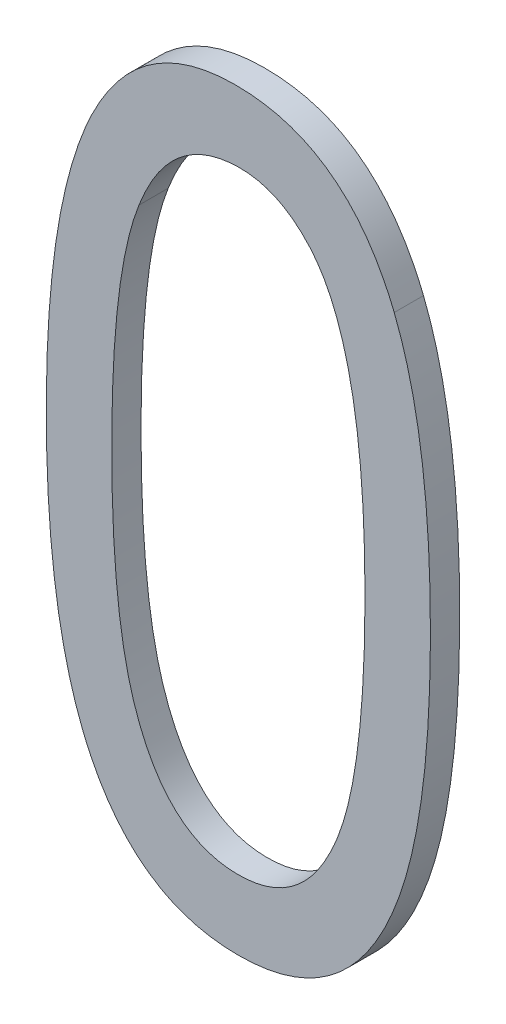
ISO-10303-21;
HEADER;
FILE_DESCRIPTION(('STEP AP214'),'2;1');
FILE_NAME('part.step','',(''),(''),'','','');
FILE_SCHEMA(('AUTOMOTIVE_DESIGN { 1 0 10303 214 1 1 1 1 }'));
ENDSEC;
DATA;
#1=APPLICATION_CONTEXT('core data for automotive mechanical design processes');
#2=APPLICATION_PROTOCOL_DEFINITION('international standard','automotive_design',2000,#1);
#3=PRODUCT_CONTEXT('',#1,'mechanical');
#4=PRODUCT('Part','Part','',(#3));
#5=PRODUCT_RELATED_PRODUCT_CATEGORY('part','',(#4));
#6=PRODUCT_DEFINITION_FORMATION('','',#4);
#7=PRODUCT_DEFINITION_CONTEXT('part definition',#1,'design');
#8=PRODUCT_DEFINITION('design','',#6,#7);
#9=PRODUCT_DEFINITION_SHAPE('','',#8);
#10=(LENGTH_UNIT() NAMED_UNIT(*) SI_UNIT(.MILLI.,.METRE.));
#11=(NAMED_UNIT(*) PLANE_ANGLE_UNIT() SI_UNIT($,.RADIAN.));
#12=(NAMED_UNIT(*) SI_UNIT($,.STERADIAN.) SOLID_ANGLE_UNIT());
#13=UNCERTAINTY_MEASURE_WITH_UNIT(LENGTH_MEASURE(1.E-05),#10,'distance_accuracy_value','');
#14=(GEOMETRIC_REPRESENTATION_CONTEXT(3) GLOBAL_UNCERTAINTY_ASSIGNED_CONTEXT((#13)) GLOBAL_UNIT_ASSIGNED_CONTEXT((#10,
#11,#12)) REPRESENTATION_CONTEXT('',''));
#15=CARTESIAN_POINT('',(0.,0.,0.));
#16=DIRECTION('',(0.,0.,1.));
#17=DIRECTION('',(1.,0.,0.));
#18=AXIS2_PLACEMENT_3D('',#15,#16,#17);
#19=CARTESIAN_POINT('',(157.73783612498,127.21231620352,-39.));
#20=DIRECTION('',(0.,0.,-1.));
#21=DIRECTION('',(-1.,0.,0.));
#22=AXIS2_PLACEMENT_3D('',#19,#20,#21);
#23=PLANE('',#22);
#24=CARTESIAN_POINT('',(157.844269103976,126.928948416499,-39.));
#25=CARTESIAN_POINT('',(157.838096337936,126.9132536326,-39.));
#26=CARTESIAN_POINT('',(157.832496840703,126.897351026162,-39.));
#27=CARTESIAN_POINT('',(157.82224949074,126.865261709913,-39.));
#28=CARTESIAN_POINT('',(157.817600457071,126.849075380124,-39.));
#29=CARTESIAN_POINT('',(157.804811702664,126.800398594227,-39.));
#30=CARTESIAN_POINT('',(157.797769941509,126.767623621181,-39.));
#31=CARTESIAN_POINT('',(157.785727385608,126.701804748235,-39.));
#32=CARTESIAN_POINT('',(157.780721703603,126.668761688815,-39.));
#33=CARTESIAN_POINT('',(157.772195833815,126.602483406797,-39.));
#34=CARTESIAN_POINT('',(157.768675881764,126.569248154551,-39.));
#35=CARTESIAN_POINT('',(157.762766196083,126.502527179504,-39.));
#36=CARTESIAN_POINT('',(157.760381729883,126.469041007509,-39.));
#37=CARTESIAN_POINT('',(157.756531442121,126.402020945451,-39.));
#38=CARTESIAN_POINT('',(157.755065528567,126.368487060503,-39.));
#39=CARTESIAN_POINT('',(157.752267150532,126.282333840904,-39.));
#40=CARTESIAN_POINT('',(157.751483853642,126.229697348207,-39.));
#41=CARTESIAN_POINT('',(157.751284336417,126.124407380514,-39.));
#42=CARTESIAN_POINT('',(157.751868536493,126.071753905273,-39.));
#43=CARTESIAN_POINT('',(157.754755505648,125.96667807193,-39.));
#44=CARTESIAN_POINT('',(157.757052094684,125.914255562964,-39.));
#45=CARTESIAN_POINT('',(157.763989386472,125.809581309509,-39.));
#46=CARTESIAN_POINT('',(157.768628714741,125.757329482952,-39.));
#47=CARTESIAN_POINT('',(157.779325689695,125.670096848505,-39.));
#48=CARTESIAN_POINT('',(157.784436679629,125.635005806207,-39.));
#49=CARTESIAN_POINT('',(157.793810517808,125.582601834786,-39.));
#50=CARTESIAN_POINT('',(157.797228122416,125.565138416614,-39.));
#51=CARTESIAN_POINT('',(157.80476356848,125.530363641215,-39.));
#52=CARTESIAN_POINT('',(157.808881281087,125.513052256623,-39.));
#53=CARTESIAN_POINT('',(157.816262983102,125.485179486085,-39.));
#54=CARTESIAN_POINT('',(157.819258723516,125.47454742445,-39.));
#55=CARTESIAN_POINT('',(157.825650621206,125.453407013795,-39.));
#56=CARTESIAN_POINT('',(157.829046712649,125.442898644748,-39.));
#57=CARTESIAN_POINT('',(157.839767837804,125.411529648948,-39.));
#58=CARTESIAN_POINT('',(157.847620560893,125.390844351044,-39.));
#59=CARTESIAN_POINT('',(157.865045953418,125.350333566177,-39.));
#60=CARTESIAN_POINT('',(157.874608915195,125.33050397234,-39.));
#61=CARTESIAN_POINT('',(157.895872790535,125.29203206789,-39.));
#62=CARTESIAN_POINT('',(157.907570453278,125.273388009324,-39.));
#63=CARTESIAN_POINT('',(157.931451748448,125.240815954733,-39.));
#64=CARTESIAN_POINT('',(157.943253379552,125.226612110534,-39.));
#65=CARTESIAN_POINT('',(157.968840064895,125.200122518193,-39.));
#66=CARTESIAN_POINT('',(157.982621957452,125.187833776389,-39.));
#67=CARTESIAN_POINT('',(158.012298706236,125.165732391389,-39.));
#68=CARTESIAN_POINT('',(158.028213969886,125.155946714029,-39.));
#69=CARTESIAN_POINT('',(158.061628954647,125.139609832536,-39.));
#70=CARTESIAN_POINT('',(158.079128169464,125.133057599154,-39.));
#71=CARTESIAN_POINT('',(158.113124331564,125.123852414056,-39.));
#72=CARTESIAN_POINT('',(158.12953234251,125.120861105097,-39.));
#73=CARTESIAN_POINT('',(158.162631753294,125.117318580688,-39.));
#74=CARTESIAN_POINT('',(158.179323768103,125.116773594918,-39.));
#75=CARTESIAN_POINT('',(158.214859456618,125.118003531979,-39.));
#76=CARTESIAN_POINT('',(158.233694475028,125.120096169284,-39.));
#77=CARTESIAN_POINT('',(158.270629654061,125.127690302764,-39.));
#78=CARTESIAN_POINT('',(158.288732119691,125.133180047794,-39.));
#79=CARTESIAN_POINT('',(158.322572910248,125.147167435493,-39.));
#80=CARTESIAN_POINT('',(158.338386429073,125.155483745995,-39.));
#81=CARTESIAN_POINT('',(158.368314857142,125.174769768659,-39.));
#82=CARTESIAN_POINT('',(158.382427141087,125.185743505126,-39.));
#83=CARTESIAN_POINT('',(158.412702085761,125.213297000385,-39.));
#84=CARTESIAN_POINT('',(158.428223667908,125.230573008783,-39.));
#85=CARTESIAN_POINT('',(158.456413273991,125.267355855728,-39.));
#86=CARTESIAN_POINT('',(158.469069276969,125.286871592626,-39.));
#87=CARTESIAN_POINT('',(158.488939768289,125.321875723024,-39.));
#88=CARTESIAN_POINT('',(158.496707333925,125.337060091012,-39.));
#89=CARTESIAN_POINT('',(158.511062154139,125.367792273056,-39.));
#90=CARTESIAN_POINT('',(158.517660596594,125.383334828578,-39.));
#91=CARTESIAN_POINT('',(158.523809682039,125.399038411206,-39.));
#92=B_SPLINE_CURVE_WITH_KNOTS('',3,(#24,#25,#26,#27,#28,#29,#30,#31,#32,#33,#34,#35,#36,#37,#38,
#39,#40,#41,#42,#43,#44,#45,#46,#47,#48,#49,#50,#51,#52,#53,#54,#55,#56,#57,#58,#59,#60,#61,#62,
#63,#64,#65,#66,#67,#68,#69,#70,#71,#72,#73,#74,#75,#76,#77,#78,#79,#80,#81,#82,#83,#84,#85,#86,
#87,#88,#89,#90,#91),.UNSPECIFIED.,.F.,.F.,(4,2,2,2,2,2,2,2,2,2,2,2,2,2,2,2,2,2,2,2,2,2,2,2,2,2,
2,2,2,2,2,2,2,4),(0.,0.0505598864734928,0.101056565921441,0.201520398804549,0.301741641931041,
0.401978780703024,0.502676488224847,0.603364109413456,0.76126634373325,0.919217128384299,
1.076600608384,1.23389185876959,1.340217066218,1.39359050964293,1.44695414085775,
1.48008500979709,1.51321043823778,1.57952088188154,1.64546623600272,1.7113119910951,
1.76654814266523,1.82169706452493,1.87741721830764,1.93311962417837,1.98294739535702,
2.03290198362782,2.08949093296343,2.1458852178383,2.19918888570101,2.25257378499885,
2.32185784254117,2.39142736965957,2.44255239605405,2.49315810580368),.UNSPECIFIED.);
#93=CARTESIAN_POINT('',(157.844269103976,126.928948416499,-39.));
#94=VERTEX_POINT('',#93);
#95=CARTESIAN_POINT('',(158.523809682039,125.399038411206,-39.));
#96=VERTEX_POINT('',#95);
#97=EDGE_CURVE('E82',#94,#96,#92,.T.);
#98=ORIENTED_EDGE('',*,*,#97,.F.);
#99=CARTESIAN_POINT('',(158.523809682039,125.399038411206,-39.));
#100=CARTESIAN_POINT('',(158.529934316547,125.414739762002,-39.));
#101=CARTESIAN_POINT('',(158.535497403933,125.430643427273,-39.));
#102=CARTESIAN_POINT('',(158.545688853036,125.462728729021,-39.));
#103=CARTESIAN_POINT('',(158.550318324701,125.478910010305,-39.));
#104=CARTESIAN_POINT('',(158.563069211101,125.527590671538,-39.));
#105=CARTESIAN_POINT('',(158.570104895971,125.560370708689,-39.));
#106=CARTESIAN_POINT('',(158.582151548238,125.626206099966,-39.));
#107=CARTESIAN_POINT('',(158.587166866103,125.659260704397,-39.));
#108=CARTESIAN_POINT('',(158.595712842765,125.725561759351,-39.));
#109=CARTESIAN_POINT('',(158.59924325848,125.758808240382,-39.));
#110=CARTESIAN_POINT('',(158.608163198449,125.858936864082,-39.));
#111=CARTESIAN_POINT('',(158.61184369748,125.925969366923,-39.));
#112=CARTESIAN_POINT('',(158.615133061655,126.026437311402,-39.));
#113=CARTESIAN_POINT('',(158.615858338715,126.059850293964,-39.));
#114=CARTESIAN_POINT('',(158.616698251436,126.126685847795,-39.));
#115=CARTESIAN_POINT('',(158.616812862173,126.1601084194,-39.));
#116=CARTESIAN_POINT('',(158.616234819698,126.26016105075,-39.));
#117=CARTESIAN_POINT('',(158.614627008926,126.326792772413,-39.));
#118=CARTESIAN_POINT('',(158.608530756221,126.447777795609,-39.));
#119=CARTESIAN_POINT('',(158.604619665592,126.502159284629,-39.));
#120=CARTESIAN_POINT('',(158.593550086107,126.610987434158,-39.));
#121=CARTESIAN_POINT('',(158.586370680784,126.665432225956,-39.));
#122=CARTESIAN_POINT('',(158.571839729773,126.746880825657,-39.));
#123=CARTESIAN_POINT('',(158.566310757433,126.774206456517,-39.));
#124=CARTESIAN_POINT('',(158.553615053888,126.828468998899,-39.));
#125=CARTESIAN_POINT('',(158.546449356754,126.855406144488,-39.));
#126=CARTESIAN_POINT('',(158.53004677356,126.908348600257,-39.));
#127=CARTESIAN_POINT('',(158.520832002633,126.934360654261,-39.));
#128=CARTESIAN_POINT('',(158.499542362986,126.985178523736,-39.));
#129=CARTESIAN_POINT('',(158.487475843784,127.009987610473,-39.));
#130=CARTESIAN_POINT('',(158.468480436507,127.041954304919,-39.));
#131=CARTESIAN_POINT('',(158.46328146928,127.050143229378,-39.));
#132=CARTESIAN_POINT('',(158.452336807433,127.066148485094,-39.));
#133=CARTESIAN_POINT('',(158.446591310434,127.073964949506,-39.));
#134=CARTESIAN_POINT('',(158.434462836872,127.089113301841,-39.));
#135=CARTESIAN_POINT('',(158.428078478826,127.096444080067,-39.));
#136=CARTESIAN_POINT('',(158.41485339144,127.110686147085,-39.));
#137=CARTESIAN_POINT('',(158.408012401858,127.117597192304,-39.));
#138=CARTESIAN_POINT('',(158.393793625772,127.130944059741,-39.));
#139=CARTESIAN_POINT('',(158.386412695476,127.137376571876,-39.));
#140=CARTESIAN_POINT('',(158.371158709093,127.1496177592,-39.));
#141=CARTESIAN_POINT('',(158.363285874064,127.155426711465,-39.));
#142=CARTESIAN_POINT('',(158.33897641086,127.171731729472,-39.));
#143=CARTESIAN_POINT('',(158.321792539608,127.181160385396,-39.));
#144=CARTESIAN_POINT('',(158.286528385787,127.196074883058,-39.));
#145=CARTESIAN_POINT('',(158.268505532505,127.201694800712,-39.));
#146=CARTESIAN_POINT('',(158.240911429808,127.207389916442,-39.));
#147=CARTESIAN_POINT('',(158.231602839897,127.208832612515,-39.));
#148=CARTESIAN_POINT('',(158.212885596433,127.210811705159,-39.));
#149=CARTESIAN_POINT('',(158.20347691604,127.21134785214,-39.));
#150=CARTESIAN_POINT('',(158.18593553201,127.21159469605,-39.));
#151=CARTESIAN_POINT('',(158.177803540063,127.211407854803,-39.));
#152=CARTESIAN_POINT('',(158.161569752278,127.210525157236,-39.));
#153=CARTESIAN_POINT('',(158.153467951912,127.209829380619,-39.));
#154=CARTESIAN_POINT('',(158.129281315581,127.206877594109,-39.));
#155=CARTESIAN_POINT('',(158.113290188107,127.203757649748,-39.));
#156=CARTESIAN_POINT('',(158.078921245801,127.19418365331,-39.));
#157=CARTESIAN_POINT('',(158.060687768501,127.187197164989,-39.));
#158=CARTESIAN_POINT('',(158.025950285674,127.169825519232,-39.));
#159=CARTESIAN_POINT('',(158.009444631725,127.159443640891,-39.));
#160=CARTESIAN_POINT('',(157.977330927786,127.134952458311,-39.));
#161=CARTESIAN_POINT('',(157.961903491712,127.120609569158,-39.));
#162=CARTESIAN_POINT('',(157.933510320261,127.089554214468,-39.));
#163=CARTESIAN_POINT('',(157.92056032965,127.07282770049,-39.));
#164=CARTESIAN_POINT('',(157.895363330817,127.035557881647,-39.));
#165=CARTESIAN_POINT('',(157.88343826081,127.01480272305,-39.));
#166=CARTESIAN_POINT('',(157.862154266613,126.97241978189,-39.));
#167=CARTESIAN_POINT('',(157.852757073177,126.950811460588,-39.));
#168=CARTESIAN_POINT('',(157.844269103976,126.928948416499,-39.));
#169=B_SPLINE_CURVE_WITH_KNOTS('',3,(#99,#100,#101,#102,#103,#104,#105,#106,#107,#108,#109,#110,
#111,#112,#113,#114,#115,#116,#117,#118,#119,#120,#121,#122,#123,#124,#125,#126,#127,#128,#129,
#130,#131,#132,#133,#134,#135,#136,#137,#138,#139,#140,#141,#142,#143,#144,#145,#146,#147,#148,
#149,#150,#151,#152,#153,#154,#155,#156,#157,#158,#159,#160,#161,#162,#163,#164,#165,#166,#167,
#168),.UNSPECIFIED.,.F.,.F.,(4,2,2,2,2,2,2,2,2,2,2,2,2,2,2,2,2,2,2,2,2,2,2,2,2,2,2,2,2,2,2,2,2,
2,4),(0.,0.0505272345243753,0.100994039860509,0.201471045431745,0.301730521681821,
0.40200640417162,0.603281732820312,0.703542383202023,0.80380712555294,1.00368636082855,
1.16719799616362,1.33177110790116,1.41537414136485,1.49892450044988,1.5816134745757,
1.66406328249432,1.69314592018909,1.72221808158008,1.75135452644101,1.78050772084134,
1.8098467496261,1.83917268730344,1.89759272369433,1.95383140320028,1.98205245785236,
2.01028128100702,2.03466611588535,2.05904713274523,2.10773462856011,2.16593738065248,
2.2240840886392,2.28693439901882,2.3501717555661,2.4218100580722,2.4922934934074),.UNSPECIFIED.);
#170=EDGE_CURVE('E80',#96,#94,#169,.T.);
#171=ORIENTED_EDGE('',*,*,#170,.F.);
#172=EDGE_LOOP('',(#98,#171));
#173=FACE_BOUND('',#172,.T.);
#174=CARTESIAN_POINT('',(158.716665923362,127.047397331269,-39.));
#175=CARTESIAN_POINT('',(158.729128239164,127.016239052959,-39.));
#176=CARTESIAN_POINT('',(158.740125756865,126.984553230297,-39.));
#177=CARTESIAN_POINT('',(158.759678379781,126.920532400283,-39.));
#178=CARTESIAN_POINT('',(158.768240663324,126.888199608038,-39.));
#179=CARTESIAN_POINT('',(158.791112456241,126.790485439633,-39.));
#180=CARTESIAN_POINT('',(158.802583499752,126.724453357786,-39.));
#181=CARTESIAN_POINT('',(158.820418902697,126.591590758617,-39.));
#182=CARTESIAN_POINT('',(158.826769050439,126.524758538115,-39.));
#183=CARTESIAN_POINT('',(158.83572153351,126.391124081756,-39.));
#184=CARTESIAN_POINT('',(158.838338777169,126.324322797827,-39.));
#185=CARTESIAN_POINT('',(158.840150901062,126.224164073656,-39.));
#186=CARTESIAN_POINT('',(158.84040345744,126.190818575861,-39.));
#187=CARTESIAN_POINT('',(158.840294162742,126.124128247136,-39.));
#188=CARTESIAN_POINT('',(158.839932312697,126.090783416205,-39.));
#189=CARTESIAN_POINT('',(158.837809823372,125.990835520696,-39.));
#190=CARTESIAN_POINT('',(158.835013644604,125.924249957834,-39.));
#191=CARTESIAN_POINT('',(158.825704667901,125.790979948071,-39.));
#192=CARTESIAN_POINT('',(158.819173784175,125.724296606593,-39.));
#193=CARTESIAN_POINT('',(158.803948947144,125.614477984008,-39.));
#194=CARTESIAN_POINT('',(158.796772827478,125.571136226896,-39.));
#195=CARTESIAN_POINT('',(158.779416795016,125.484991781117,-39.));
#196=CARTESIAN_POINT('',(158.769234369272,125.442189574791,-39.));
#197=CARTESIAN_POINT('',(158.74487210202,125.358090061591,-39.));
#198=CARTESIAN_POINT('',(158.730725542093,125.316783327719,-39.));
#199=CARTESIAN_POINT('',(158.697649269017,125.236169628208,-39.));
#200=CARTESIAN_POINT('',(158.678731894315,125.196857813552,-39.));
#201=CARTESIAN_POINT('',(158.641098532501,125.132691357331,-39.));
#202=CARTESIAN_POINT('',(158.623915835721,125.10695083373,-39.));
#203=CARTESIAN_POINT('',(158.585998451762,125.058191271206,-39.));
#204=CARTESIAN_POINT('',(158.565265399402,125.035170987913,-39.));
#205=CARTESIAN_POINT('',(158.519839793068,124.992782631732,-39.));
#206=CARTESIAN_POINT('',(158.495104476091,124.973459568495,-39.));
#207=CARTESIAN_POINT('',(158.442369220109,124.94000460659,-39.));
#208=CARTESIAN_POINT('',(158.414374536906,124.925864498956,-39.));
#209=CARTESIAN_POINT('',(158.359550731814,124.904553866301,-39.));
#210=CARTESIAN_POINT('',(158.332954872297,124.896770916636,-39.));
#211=CARTESIAN_POINT('',(158.278821133743,124.885416501214,-39.));
#212=CARTESIAN_POINT('',(158.251280833532,124.881856845887,-39.));
#213=CARTESIAN_POINT('',(158.208651512507,124.879213715785,-39.));
#214=CARTESIAN_POINT('',(158.193623870221,124.878828071462,-39.));
#215=CARTESIAN_POINT('',(158.163575979002,124.879051701823,-39.));
#216=CARTESIAN_POINT('',(158.148555730446,124.879661022907,-39.));
#217=CARTESIAN_POINT('',(158.10366112077,124.883152868919,-39.));
#218=CARTESIAN_POINT('',(158.07388488193,124.887694520213,-39.));
#219=CARTESIAN_POINT('',(158.017955660165,124.901266698453,-39.));
#220=CARTESIAN_POINT('',(157.991706502792,124.909895658549,-39.));
#221=CARTESIAN_POINT('',(157.941116339552,124.931519950501,-39.));
#222=CARTESIAN_POINT('',(157.916771742503,124.944506807961,-39.));
#223=CARTESIAN_POINT('',(157.870741139345,124.974383658127,-39.));
#224=CARTESIAN_POINT('',(157.84904671037,124.991260765327,-39.));
#225=CARTESIAN_POINT('',(157.808457209688,125.028261644664,-39.));
#226=CARTESIAN_POINT('',(157.789577507442,125.04840207252,-39.));
#227=CARTESIAN_POINT('',(157.746160642892,125.101439244545,-39.));
#228=CARTESIAN_POINT('',(157.723385926764,125.135750005299,-39.));
#229=CARTESIAN_POINT('',(157.683536177793,125.206979693701,-39.));
#230=CARTESIAN_POINT('',(157.66638882278,125.243857486226,-39.));
#231=CARTESIAN_POINT('',(157.651412862653,125.281251222217,-39.));
#232=B_SPLINE_CURVE_WITH_KNOTS('',3,(#174,#175,#176,#177,#178,#179,#180,#181,#182,#183,#184,
#185,#186,#187,#188,#189,#190,#191,#192,#193,#194,#195,#196,#197,#198,#199,#200,#201,#202,#203,
#204,#205,#206,#207,#208,#209,#210,#211,#212,#213,#214,#215,#216,#217,#218,#219,#220,#221,#222,
#223,#224,#225,#226,#227,#228,#229,#230,#231),.UNSPECIFIED.,.F.,.F.,(4,2,2,2,2,2,2,2,2,2,2,2,2,
2,2,2,2,2,2,2,2,2,2,2,2,2,2,2,4),(0.,0.100558694918939,0.200817826406555,0.401542047706447,
0.602821427213969,0.803294672023324,0.903330108470098,1.00336537691819,1.20322873447947,
1.40406825296397,1.53579185395421,1.66762587495605,1.79838461587444,1.92880859115149,
2.02140063548079,2.11395015836421,2.20756322165537,2.30102736961858,2.38379518702786,
2.46679392288334,2.51186322136468,2.55693462169346,2.64687466350647,2.7293891063786,
2.81174401210947,2.89382996037305,2.97634889005733,3.09931227669102,3.22062708793923),.UNSPECIFIED.);
#233=CARTESIAN_POINT('',(158.716665923362,127.047397331269,-39.));
#234=VERTEX_POINT('',#233);
#235=CARTESIAN_POINT('',(157.651412862653,125.281251222217,-39.));
#236=VERTEX_POINT('',#235);
#237=EDGE_CURVE('E67',#234,#236,#232,.T.);
#238=ORIENTED_EDGE('',*,*,#237,.F.);
#239=CARTESIAN_POINT('',(157.651412862653,125.281251222217,-39.));
#240=CARTESIAN_POINT('',(157.638984311187,125.312438437969,-39.));
#241=CARTESIAN_POINT('',(157.628009236291,125.344151570257,-39.));
#242=CARTESIAN_POINT('',(157.608503835542,125.408186833191,-39.));
#243=CARTESIAN_POINT('',(157.599963713349,125.440505949572,-39.));
#244=CARTESIAN_POINT('',(157.584764446882,125.505605658729,-39.));
#245=CARTESIAN_POINT('',(157.578107372254,125.538386718016,-39.));
#246=CARTESIAN_POINT('',(157.566347224829,125.604230220191,-39.));
#247=CARTESIAN_POINT('',(157.56124447365,125.637292719861,-39.));
#248=CARTESIAN_POINT('',(157.55231253597,125.703715925087,-39.));
#249=CARTESIAN_POINT('',(157.54848834561,125.737077289236,-39.));
#250=CARTESIAN_POINT('',(157.54193917703,125.803902241854,-39.));
#251=CARTESIAN_POINT('',(157.539214102009,125.837365821059,-39.));
#252=CARTESIAN_POINT('',(157.532518841782,125.936709324496,-39.));
#253=CARTESIAN_POINT('',(157.529888269067,126.002680957742,-39.));
#254=CARTESIAN_POINT('',(157.527990597248,126.101675553336,-39.));
#255=CARTESIAN_POINT('',(157.527699577175,126.134687712191,-39.));
#256=CARTESIAN_POINT('',(157.527746927672,126.200719925422,-39.));
#257=CARTESIAN_POINT('',(157.52808544261,126.233739979873,-39.));
#258=CARTESIAN_POINT('',(157.530179914467,126.332578651519,-39.));
#259=CARTESIAN_POINT('',(157.533010211979,126.398379850558,-39.));
#260=CARTESIAN_POINT('',(157.542376044476,126.529710864489,-39.));
#261=CARTESIAN_POINT('',(157.548909822878,126.595240793214,-39.));
#262=CARTESIAN_POINT('',(157.56515132149,126.712240766797,-39.));
#263=CARTESIAN_POINT('',(157.573932130739,126.763835532175,-39.));
#264=CARTESIAN_POINT('',(157.595722164062,126.866292871823,-39.));
#265=CARTESIAN_POINT('',(157.608741188288,126.917153461004,-39.));
#266=CARTESIAN_POINT('',(157.640704104676,127.017784134273,-39.));
#267=CARTESIAN_POINT('',(157.659724305962,127.067530800492,-39.));
#268=CARTESIAN_POINT('',(157.705922602257,127.16310818111,-39.));
#269=CARTESIAN_POINT('',(157.733058560108,127.208957588125,-39.));
#270=CARTESIAN_POINT('',(157.782784888237,127.273097291112,-39.));
#271=CARTESIAN_POINT('',(157.801609468517,127.294280019061,-39.));
#272=CARTESIAN_POINT('',(157.842395984659,127.333358878961,-39.));
#273=CARTESIAN_POINT('',(157.86435227679,127.351260793533,-39.));
#274=CARTESIAN_POINT('',(157.911278643165,127.382968304412,-39.));
#275=CARTESIAN_POINT('',(157.936267502944,127.396746322067,-39.));
#276=CARTESIAN_POINT('',(157.988380061441,127.419488708747,-39.));
#277=CARTESIAN_POINT('',(158.015506030524,127.42844787719,-39.));
#278=CARTESIAN_POINT('',(158.059065188712,127.438826092904,-39.));
#279=CARTESIAN_POINT('',(158.075146319053,127.441831460384,-39.));
#280=CARTESIAN_POINT('',(158.107521322144,127.446389016085,-39.));
#281=CARTESIAN_POINT('',(158.123815273998,127.447940647427,-39.));
#282=CARTESIAN_POINT('',(158.156515562222,127.449709274447,-39.));
#283=CARTESIAN_POINT('',(158.172922086812,127.449922434881,-39.));
#284=CARTESIAN_POINT('',(158.205708846208,127.449196107889,-39.));
#285=CARTESIAN_POINT('',(158.222089080777,127.448256610121,-39.));
#286=CARTESIAN_POINT('',(158.255103218363,127.445045138324,-39.));
#287=CARTESIAN_POINT('',(158.271734365268,127.442743207883,-39.));
#288=CARTESIAN_POINT('',(158.304720154644,127.436680429767,-39.));
#289=CARTESIAN_POINT('',(158.321074862667,127.43291993317,-39.));
#290=CARTESIAN_POINT('',(158.369337265434,127.419338018988,-39.));
#291=CARTESIAN_POINT('',(158.400643098141,127.407199497072,-39.));
#292=CARTESIAN_POINT('',(158.457150667123,127.378277724819,-39.));
#293=CARTESIAN_POINT('',(158.48264992141,127.362069578845,-39.));
#294=CARTESIAN_POINT('',(158.530413809674,127.325361282832,-39.));
#295=CARTESIAN_POINT('',(158.552670126084,127.304850414372,-39.));
#296=CARTESIAN_POINT('',(158.59934864818,127.25450729803,-39.));
#297=CARTESIAN_POINT('',(158.622669045759,127.223665617726,-39.));
#298=CARTESIAN_POINT('',(158.664171808008,127.158771336517,-39.));
#299=CARTESIAN_POINT('',(158.682349356066,127.124715765133,-39.));
#300=CARTESIAN_POINT('',(158.704823511199,127.075747667785,-39.));
#301=CARTESIAN_POINT('',(158.710898374823,127.061626812378,-39.));
#302=CARTESIAN_POINT('',(158.716665923362,127.047397331269,-39.));
#303=B_SPLINE_CURVE_WITH_KNOTS('',3,(#239,#240,#241,#242,#243,#244,#245,#246,#247,#248,#249,
#250,#251,#252,#253,#254,#255,#256,#257,#258,#259,#260,#261,#262,#263,#264,#265,#266,#267,#268,
#269,#270,#271,#272,#273,#274,#275,#276,#277,#278,#279,#280,#281,#282,#283,#284,#285,#286,#287,
#288,#289,#290,#291,#292,#293,#294,#295,#296,#297,#298,#299,#300,#301,#302),.UNSPECIFIED.,.F.,
.F.,(4,2,2,2,2,2,2,2,2,2,2,2,2,2,2,2,2,2,2,2,2,2,2,2,2,2,2,2,2,2,2,4),(0.,0.100610747931714,
0.200810813564856,0.301120584387844,0.401451097140948,0.50216920297923,0.602878436567652,
0.800859480675461,0.89989660398492,0.998956441695543,1.19646422326839,1.39387840405582,
1.55076633803233,1.70801965667097,1.86735912610107,2.02588525484839,2.1106047433598,
2.19517344188481,2.28029566957889,2.36550957918119,2.41452921553226,2.46356762208275,
2.51274647897382,2.56192577708438,2.61222881688943,2.66251975628304,2.76250912971264,
2.8526519993968,2.94302214686465,3.05837189556553,3.17382932187337,3.21991944188319),.UNSPECIFIED.);
#304=EDGE_CURVE('E24',#236,#234,#303,.T.);
#305=ORIENTED_EDGE('',*,*,#304,.F.);
#306=EDGE_LOOP('',(#238,#305));
#307=FACE_BOUND('',#306,.T.);
#308=ADVANCED_FACE('F17',(#173,#307),#23,.F.);
#309=CARTESIAN_POINT('',(158.716665923362,127.047397331269,-39.1));
#310=CARTESIAN_POINT('',(158.716665923362,127.047397331269,-39.));
#311=CARTESIAN_POINT('',(158.608121180209,127.315396272508,-39.1));
#312=CARTESIAN_POINT('',(158.608121180209,127.315396272508,-39.));
#313=CARTESIAN_POINT('',(158.426876702108,127.449726606018,-39.1));
#314=CARTESIAN_POINT('',(158.426876702108,127.449726606018,-39.));
#315=CARTESIAN_POINT('',(157.74329724988,127.449726606018,-39.1));
#316=CARTESIAN_POINT('',(157.74329724988,127.449726606018,-39.));
#317=CARTESIAN_POINT('',(157.527722341386,127.021590025817,-39.1));
#318=CARTESIAN_POINT('',(157.527722341386,127.021590025817,-39.));
#319=CARTESIAN_POINT('',(157.527722341386,125.781515912529,-39.1));
#320=CARTESIAN_POINT('',(157.527722341386,125.781515912529,-39.));
#321=CARTESIAN_POINT('',(157.569120801565,125.487047940057,-39.1));
#322=CARTESIAN_POINT('',(157.569120801565,125.487047940057,-39.));
#323=CARTESIAN_POINT('',(157.651412862653,125.281251222217,-39.1));
#324=CARTESIAN_POINT('',(157.651412862653,125.281251222217,-39.));
#325=B_SPLINE_SURFACE_WITH_KNOTS('',3,1,((#309,#310),(#311,#312),(#313,#314),(#315,#316),(#317,
#318),(#319,#320),(#321,#322),(#323,#324)),.UNSPECIFIED.,.F.,.F.,.F.,(4,2,2,4),(2,2),(0.,
0.288697589169669,0.780232606258932,1.),(1.,1.1),.UNSPECIFIED.);
#326=CARTESIAN_POINT('',(157.651412862653,125.281251222217,-39.1));
#327=CARTESIAN_POINT('',(157.638984311187,125.312438437969,-39.1));
#328=CARTESIAN_POINT('',(157.628009236291,125.344151570257,-39.1));
#329=CARTESIAN_POINT('',(157.608503835542,125.408186833191,-39.1));
#330=CARTESIAN_POINT('',(157.599963713349,125.440505949572,-39.1));
#331=CARTESIAN_POINT('',(157.584764446882,125.505605658729,-39.1));
#332=CARTESIAN_POINT('',(157.578107372254,125.538386718016,-39.1));
#333=CARTESIAN_POINT('',(157.566347224829,125.604230220191,-39.1));
#334=CARTESIAN_POINT('',(157.56124447365,125.637292719861,-39.1));
#335=CARTESIAN_POINT('',(157.55231253597,125.703715925087,-39.1));
#336=CARTESIAN_POINT('',(157.54848834561,125.737077289236,-39.1));
#337=CARTESIAN_POINT('',(157.54193917703,125.803902241854,-39.1));
#338=CARTESIAN_POINT('',(157.539214102009,125.837365821059,-39.1));
#339=CARTESIAN_POINT('',(157.532518841782,125.936709324496,-39.1));
#340=CARTESIAN_POINT('',(157.529888269067,126.002680957742,-39.1));
#341=CARTESIAN_POINT('',(157.527990597248,126.101675553336,-39.1));
#342=CARTESIAN_POINT('',(157.527699577175,126.134687712191,-39.1));
#343=CARTESIAN_POINT('',(157.527746927672,126.200719925422,-39.1));
#344=CARTESIAN_POINT('',(157.52808544261,126.233739979873,-39.1));
#345=CARTESIAN_POINT('',(157.530179914467,126.332578651519,-39.1));
#346=CARTESIAN_POINT('',(157.533010211979,126.398379850558,-39.1));
#347=CARTESIAN_POINT('',(157.542376044476,126.529710864489,-39.1));
#348=CARTESIAN_POINT('',(157.548909822878,126.595240793214,-39.1));
#349=CARTESIAN_POINT('',(157.56515132149,126.712240766797,-39.1));
#350=CARTESIAN_POINT('',(157.573932130739,126.763835532175,-39.1));
#351=CARTESIAN_POINT('',(157.595722164062,126.866292871823,-39.1));
#352=CARTESIAN_POINT('',(157.608741188288,126.917153461004,-39.1));
#353=CARTESIAN_POINT('',(157.640704104676,127.017784134273,-39.1));
#354=CARTESIAN_POINT('',(157.659724305962,127.067530800492,-39.1));
#355=CARTESIAN_POINT('',(157.705922602257,127.16310818111,-39.1));
#356=CARTESIAN_POINT('',(157.733058560108,127.208957588125,-39.1));
#357=CARTESIAN_POINT('',(157.782784888237,127.273097291112,-39.1));
#358=CARTESIAN_POINT('',(157.801609468517,127.294280019061,-39.1));
#359=CARTESIAN_POINT('',(157.842395984659,127.333358878961,-39.1));
#360=CARTESIAN_POINT('',(157.86435227679,127.351260793533,-39.1));
#361=CARTESIAN_POINT('',(157.911278643165,127.382968304412,-39.1));
#362=CARTESIAN_POINT('',(157.936267502944,127.396746322067,-39.1));
#363=CARTESIAN_POINT('',(157.988380061441,127.419488708747,-39.1));
#364=CARTESIAN_POINT('',(158.015506030524,127.42844787719,-39.1));
#365=CARTESIAN_POINT('',(158.059065188712,127.438826092904,-39.1));
#366=CARTESIAN_POINT('',(158.075146319053,127.441831460384,-39.1));
#367=CARTESIAN_POINT('',(158.107521322144,127.446389016085,-39.1));
#368=CARTESIAN_POINT('',(158.123815273998,127.447940647427,-39.1));
#369=CARTESIAN_POINT('',(158.156515562222,127.449709274447,-39.1));
#370=CARTESIAN_POINT('',(158.172922086812,127.449922434881,-39.1));
#371=CARTESIAN_POINT('',(158.205708846208,127.449196107889,-39.1));
#372=CARTESIAN_POINT('',(158.222089080777,127.448256610121,-39.1));
#373=CARTESIAN_POINT('',(158.255103218363,127.445045138324,-39.1));
#374=CARTESIAN_POINT('',(158.271734365268,127.442743207883,-39.1));
#375=CARTESIAN_POINT('',(158.304720154644,127.436680429768,-39.1));
#376=CARTESIAN_POINT('',(158.321074862667,127.43291993317,-39.1));
#377=CARTESIAN_POINT('',(158.369337265434,127.419338018988,-39.1));
#378=CARTESIAN_POINT('',(158.400643098141,127.407199497072,-39.1));
#379=CARTESIAN_POINT('',(158.457150667123,127.378277724819,-39.1));
#380=CARTESIAN_POINT('',(158.48264992141,127.362069578845,-39.1));
#381=CARTESIAN_POINT('',(158.530413809674,127.325361282832,-39.1));
#382=CARTESIAN_POINT('',(158.552670126084,127.304850414372,-39.1));
#383=CARTESIAN_POINT('',(158.59934864818,127.25450729803,-39.1));
#384=CARTESIAN_POINT('',(158.622669045759,127.223665617726,-39.1));
#385=CARTESIAN_POINT('',(158.664171808008,127.158771336517,-39.1));
#386=CARTESIAN_POINT('',(158.682349356066,127.124715765133,-39.1));
#387=CARTESIAN_POINT('',(158.704823511199,127.075747667785,-39.1));
#388=CARTESIAN_POINT('',(158.710898374823,127.061626812378,-39.1));
#389=CARTESIAN_POINT('',(158.716665923362,127.047397331269,-39.1));
#390=B_SPLINE_CURVE_WITH_KNOTS('',3,(#326,#327,#328,#329,#330,#331,#332,#333,#334,#335,#336,
#337,#338,#339,#340,#341,#342,#343,#344,#345,#346,#347,#348,#349,#350,#351,#352,#353,#354,#355,
#356,#357,#358,#359,#360,#361,#362,#363,#364,#365,#366,#367,#368,#369,#370,#371,#372,#373,#374,
#375,#376,#377,#378,#379,#380,#381,#382,#383,#384,#385,#386,#387,#388,#389),.UNSPECIFIED.,.F.,
.F.,(4,2,2,2,2,2,2,2,2,2,2,2,2,2,2,2,2,2,2,2,2,2,2,2,2,2,2,2,2,2,2,4),(0.,0.100610747931723,
0.200810813564858,0.30112058438784,0.401451097140945,0.502169202979227,0.602878436567651,
0.800859480675461,0.89989660398492,0.998956441695543,1.19646422326839,1.39387840405582,
1.55076633803233,1.70801965667096,1.86735912610107,2.02588525484836,2.11060474335979,
2.19517344188478,2.28029566957889,2.36550957918118,2.41452921553226,2.46356762208278,
2.51274647897388,2.56192577708444,2.61222881688952,2.66251975628316,2.76250912971281,
2.85265199939691,2.94302214686464,3.05837189556555,3.17382932187341,3.2199194418832),.UNSPECIFIED.);
#391=CARTESIAN_POINT('',(157.651412862653,125.281251222217,-39.1));
#392=VERTEX_POINT('',#391);
#393=CARTESIAN_POINT('',(158.716665923362,127.047397331269,-39.1));
#394=VERTEX_POINT('',#393);
#395=EDGE_CURVE('E111',#392,#394,#390,.T.);
#396=DIRECTION('',(0.,0.,-1.));
#397=VECTOR('',#396,1.);
#398=CARTESIAN_POINT('',(157.651412862653,125.281251222217,-39.05));
#399=LINE('',#398,#397);
#400=EDGE_CURVE('E71',#236,#392,#399,.T.);
#401=DIRECTION('',(0.,0.,1.));
#402=VECTOR('',#401,1.);
#403=CARTESIAN_POINT('',(158.716665923362,127.047397331269,-39.05));
#404=LINE('',#403,#402);
#405=EDGE_CURVE('E74',#394,#234,#404,.T.);
#406=ORIENTED_EDGE('',*,*,#395,.F.);
#407=ORIENTED_EDGE('',*,*,#400,.F.);
#408=ORIENTED_EDGE('',*,*,#304,.T.);
#409=ORIENTED_EDGE('',*,*,#405,.F.);
#410=EDGE_LOOP('',(#406,#407,#408,#409));
#411=FACE_BOUND('',#410,.T.);
#412=ADVANCED_FACE('F73',(#411),#325,.T.);
#413=CARTESIAN_POINT('',(157.651412862653,125.281251222217,-39.1));
#414=CARTESIAN_POINT('',(157.651412862653,125.281251222217,-39.));
#415=CARTESIAN_POINT('',(157.759067155675,125.012028409316,-39.1));
#416=CARTESIAN_POINT('',(157.759067155675,125.012028409316,-39.));
#417=CARTESIAN_POINT('',(157.937668069014,124.878921947468,-39.1));
#418=CARTESIAN_POINT('',(157.937668069014,124.878921947468,-39.));
#419=CARTESIAN_POINT('',(158.45060508782,124.878921947468,-39.1));
#420=CARTESIAN_POINT('',(158.45060508782,124.878921947468,-39.));
#421=CARTESIAN_POINT('',(158.636898158627,125.036412683307,-39.1));
#422=CARTESIAN_POINT('',(158.636898158627,125.036412683307,-39.));
#423=CARTESIAN_POINT('',(158.807838481764,125.549151100071,-39.1));
#424=CARTESIAN_POINT('',(158.807838481764,125.549151100071,-39.));
#425=CARTESIAN_POINT('',(158.840356444629,125.820557733598,-39.1));
#426=CARTESIAN_POINT('',(158.840356444629,125.820557733598,-39.));
#427=CARTESIAN_POINT('',(158.840356444629,126.549117818299,-39.1));
#428=CARTESIAN_POINT('',(158.840356444629,126.549117818299,-39.));
#429=CARTESIAN_POINT('',(158.79895798445,126.84226233921,-39.1));
#430=CARTESIAN_POINT('',(158.79895798445,126.84226233921,-39.));
#431=CARTESIAN_POINT('',(158.716665923362,127.047397331269,-39.1));
#432=CARTESIAN_POINT('',(158.716665923362,127.047397331269,-39.));
#433=B_SPLINE_SURFACE_WITH_KNOTS('',3,1,((#413,#414),(#415,#416),(#417,#418),(#419,#420),(#421,
#422),(#423,#424),(#425,#426),(#427,#428),(#429,#430),(#431,#432)),.UNSPECIFIED.,.F.,.F.,.F.,(4,
2,2,2,4),(2,2),(0.,0.283935469100302,0.592358186049071,0.785997303847743,1.),(1.,1.1),.UNSPECIFIED.);
#434=CARTESIAN_POINT('',(158.716665923362,127.047397331269,-39.1));
#435=CARTESIAN_POINT('',(158.729128239164,127.016239052959,-39.1));
#436=CARTESIAN_POINT('',(158.740125756865,126.984553230297,-39.1));
#437=CARTESIAN_POINT('',(158.759678379781,126.920532400283,-39.1));
#438=CARTESIAN_POINT('',(158.768240663324,126.888199608038,-39.1));
#439=CARTESIAN_POINT('',(158.791112456241,126.790485439633,-39.1));
#440=CARTESIAN_POINT('',(158.802583499752,126.724453357786,-39.1));
#441=CARTESIAN_POINT('',(158.820418902697,126.591590758617,-39.1));
#442=CARTESIAN_POINT('',(158.826769050439,126.524758538115,-39.1));
#443=CARTESIAN_POINT('',(158.83572153351,126.391124081756,-39.1));
#444=CARTESIAN_POINT('',(158.838338777169,126.324322797827,-39.1));
#445=CARTESIAN_POINT('',(158.840150901062,126.224164073656,-39.1));
#446=CARTESIAN_POINT('',(158.84040345744,126.190818575861,-39.1));
#447=CARTESIAN_POINT('',(158.840294162742,126.124128247136,-39.1));
#448=CARTESIAN_POINT('',(158.839932312697,126.090783416205,-39.1));
#449=CARTESIAN_POINT('',(158.837809823372,125.990835520696,-39.1));
#450=CARTESIAN_POINT('',(158.835013644604,125.924249957834,-39.1));
#451=CARTESIAN_POINT('',(158.8257046679,125.790979948071,-39.1));
#452=CARTESIAN_POINT('',(158.819173784175,125.724296606593,-39.1));
#453=CARTESIAN_POINT('',(158.803948947144,125.614477984008,-39.1));
#454=CARTESIAN_POINT('',(158.796772827478,125.571136226896,-39.1));
#455=CARTESIAN_POINT('',(158.779416795016,125.484991781117,-39.1));
#456=CARTESIAN_POINT('',(158.769234369272,125.442189574791,-39.1));
#457=CARTESIAN_POINT('',(158.74487210202,125.358090061591,-39.1));
#458=CARTESIAN_POINT('',(158.730725542093,125.316783327719,-39.1));
#459=CARTESIAN_POINT('',(158.697649269017,125.236169628208,-39.1));
#460=CARTESIAN_POINT('',(158.678731894315,125.196857813552,-39.1));
#461=CARTESIAN_POINT('',(158.641098532501,125.132691357331,-39.1));
#462=CARTESIAN_POINT('',(158.623915835721,125.10695083373,-39.1));
#463=CARTESIAN_POINT('',(158.585998451762,125.058191271206,-39.1));
#464=CARTESIAN_POINT('',(158.565265399402,125.035170987913,-39.1));
#465=CARTESIAN_POINT('',(158.519839793068,124.992782631732,-39.1));
#466=CARTESIAN_POINT('',(158.495104476091,124.973459568495,-39.1));
#467=CARTESIAN_POINT('',(158.442369220109,124.94000460659,-39.1));
#468=CARTESIAN_POINT('',(158.414374536906,124.925864498956,-39.1));
#469=CARTESIAN_POINT('',(158.359550731814,124.904553866301,-39.1));
#470=CARTESIAN_POINT('',(158.332954872297,124.896770916636,-39.1));
#471=CARTESIAN_POINT('',(158.278821133743,124.885416501214,-39.1));
#472=CARTESIAN_POINT('',(158.251280833532,124.881856845887,-39.0999999999999));
#473=CARTESIAN_POINT('',(158.208651512507,124.879213715785,-39.1));
#474=CARTESIAN_POINT('',(158.193623870221,124.878828071462,-39.1));
#475=CARTESIAN_POINT('',(158.163575979002,124.879051701823,-39.1));
#476=CARTESIAN_POINT('',(158.148555730446,124.879661022907,-39.1));
#477=CARTESIAN_POINT('',(158.10366112077,124.883152868919,-39.1));
#478=CARTESIAN_POINT('',(158.07388488193,124.887694520213,-39.1));
#479=CARTESIAN_POINT('',(158.017955660165,124.901266698453,-39.1));
#480=CARTESIAN_POINT('',(157.991706502792,124.909895658549,-39.1));
#481=CARTESIAN_POINT('',(157.941116339552,124.931519950501,-39.1));
#482=CARTESIAN_POINT('',(157.916771742503,124.944506807961,-39.1));
#483=CARTESIAN_POINT('',(157.870741139345,124.974383658127,-39.1));
#484=CARTESIAN_POINT('',(157.84904671037,124.991260765327,-39.1));
#485=CARTESIAN_POINT('',(157.808457209688,125.028261644663,-39.1));
#486=CARTESIAN_POINT('',(157.789577507442,125.04840207252,-39.1));
#487=CARTESIAN_POINT('',(157.746160642892,125.101439244544,-39.1));
#488=CARTESIAN_POINT('',(157.723385926764,125.135750005299,-39.1));
#489=CARTESIAN_POINT('',(157.683536177793,125.206979693701,-39.1));
#490=CARTESIAN_POINT('',(157.66638882278,125.243857486225,-39.1));
#491=CARTESIAN_POINT('',(157.651412862653,125.281251222217,-39.1));
#492=B_SPLINE_CURVE_WITH_KNOTS('',3,(#434,#435,#436,#437,#438,#439,#440,#441,#442,#443,#444,
#445,#446,#447,#448,#449,#450,#451,#452,#453,#454,#455,#456,#457,#458,#459,#460,#461,#462,#463,
#464,#465,#466,#467,#468,#469,#470,#471,#472,#473,#474,#475,#476,#477,#478,#479,#480,#481,#482,
#483,#484,#485,#486,#487,#488,#489,#490,#491),.UNSPECIFIED.,.F.,.F.,(4,2,2,2,2,2,2,2,2,2,2,2,2,
2,2,2,2,2,2,2,2,2,2,2,2,2,2,2,4),(0.,0.100558694918913,0.200817826406555,0.401542047706452,
0.602821427213972,0.803294672023326,0.9033301084701,1.00336537691819,1.20322873447947,
1.40406825296398,1.53579185395423,1.66762587495604,1.79838461587442,1.92880859115149,
2.02140063548081,2.11395015836424,2.20756322165538,2.30102736961862,2.38379518702793,
2.46679392288346,2.51186322136477,2.55693462169349,2.64687466350644,2.72938910637855,
2.81174401210933,2.89382996037286,2.9763488900571,3.09931227669094,3.22062708793923),.UNSPECIFIED.);
#493=EDGE_CURVE('E78',#394,#392,#492,.T.);
#494=ORIENTED_EDGE('',*,*,#493,.F.);
#495=ORIENTED_EDGE('',*,*,#405,.T.);
#496=ORIENTED_EDGE('',*,*,#237,.T.);
#497=ORIENTED_EDGE('',*,*,#400,.T.);
#498=EDGE_LOOP('',(#494,#495,#496,#497));
#499=FACE_BOUND('',#498,.T.);
#500=ADVANCED_FACE('F76',(#499),#433,.T.);
#501=CARTESIAN_POINT('',(157.844269103976,126.928948416499,-39.1));
#502=CARTESIAN_POINT('',(157.844269103976,126.928948416499,-39.));
#503=CARTESIAN_POINT('',(157.916968838924,127.116878538257,-39.1));
#504=CARTESIAN_POINT('',(157.916968838924,127.116878538257,-39.));
#505=CARTESIAN_POINT('',(158.032076752593,127.211505324917,-39.1));
#506=CARTESIAN_POINT('',(158.032076752593,127.211505324917,-39.));
#507=CARTESIAN_POINT('',(158.28147723221,127.211505324917,-39.1));
#508=CARTESIAN_POINT('',(158.28147723221,127.211505324917,-39.));
#509=CARTESIAN_POINT('',(158.362254715486,127.171801778066,-39.1));
#510=CARTESIAN_POINT('',(158.362254715486,127.171801778066,-39.));
#511=CARTESIAN_POINT('',(158.554375126065,126.951463841098,-39.1));
#512=CARTESIAN_POINT('',(158.554375126065,126.951463841098,-39.));
#513=CARTESIAN_POINT('',(158.616703787807,126.641759427616,-39.1));
#514=CARTESIAN_POINT('',(158.616703787807,126.641759427616,-39.));
#515=CARTESIAN_POINT('',(158.616703787807,125.812617024228,-39.1));
#516=CARTESIAN_POINT('',(158.616703787807,125.812617024228,-39.));
#517=CARTESIAN_POINT('',(158.585907372308,125.557852598606,-39.1));
#518=CARTESIAN_POINT('',(158.585907372308,125.557852598606,-39.));
#519=CARTESIAN_POINT('',(158.523809682039,125.399038411206,-39.1));
#520=CARTESIAN_POINT('',(158.523809682039,125.399038411206,-39.));
#521=B_SPLINE_SURFACE_WITH_KNOTS('',3,1,((#501,#502),(#503,#504),(#505,#506),(#507,#508),(#509,
#510),(#511,#512),(#513,#514),(#515,#516),(#517,#518),(#519,#520)),.UNSPECIFIED.,.F.,.F.,.F.,(4,
2,2,2,4),(2,2),(0.,0.295831154739349,0.466902844860171,0.774507987051788,1.),(1.,1.1),.UNSPECIFIED.);
#522=CARTESIAN_POINT('',(158.523809682039,125.399038411206,-39.1));
#523=CARTESIAN_POINT('',(158.529934316547,125.414739762002,-39.1));
#524=CARTESIAN_POINT('',(158.535497403933,125.430643427273,-39.1));
#525=CARTESIAN_POINT('',(158.545688853036,125.462728729021,-39.1));
#526=CARTESIAN_POINT('',(158.550318324701,125.478910010305,-39.1));
#527=CARTESIAN_POINT('',(158.563069211101,125.527590671538,-39.1));
#528=CARTESIAN_POINT('',(158.570104895971,125.560370708689,-39.1));
#529=CARTESIAN_POINT('',(158.582151548238,125.626206099966,-39.1));
#530=CARTESIAN_POINT('',(158.587166866103,125.659260704397,-39.1));
#531=CARTESIAN_POINT('',(158.595712842765,125.725561759351,-39.1));
#532=CARTESIAN_POINT('',(158.59924325848,125.758808240382,-39.1));
#533=CARTESIAN_POINT('',(158.608163198449,125.858936864082,-39.1));
#534=CARTESIAN_POINT('',(158.61184369748,125.925969366923,-39.1));
#535=CARTESIAN_POINT('',(158.615133061655,126.026437311402,-39.1));
#536=CARTESIAN_POINT('',(158.615858338715,126.059850293964,-39.1));
#537=CARTESIAN_POINT('',(158.616698251436,126.126685847795,-39.1));
#538=CARTESIAN_POINT('',(158.616812862173,126.1601084194,-39.1));
#539=CARTESIAN_POINT('',(158.616234819698,126.26016105075,-39.1));
#540=CARTESIAN_POINT('',(158.614627008926,126.326792772413,-39.1));
#541=CARTESIAN_POINT('',(158.608530756221,126.447777795609,-39.1));
#542=CARTESIAN_POINT('',(158.604619665592,126.502159284629,-39.1));
#543=CARTESIAN_POINT('',(158.593550086107,126.610987434158,-39.1));
#544=CARTESIAN_POINT('',(158.586370680784,126.665432225956,-39.1));
#545=CARTESIAN_POINT('',(158.571839729773,126.746880825657,-39.1));
#546=CARTESIAN_POINT('',(158.566310757433,126.774206456517,-39.1));
#547=CARTESIAN_POINT('',(158.553615053888,126.828468998899,-39.1));
#548=CARTESIAN_POINT('',(158.546449356754,126.855406144488,-39.1));
#549=CARTESIAN_POINT('',(158.53004677356,126.908348600257,-39.1));
#550=CARTESIAN_POINT('',(158.520832002633,126.934360654261,-39.1));
#551=CARTESIAN_POINT('',(158.499542362985,126.985178523737,-39.1));
#552=CARTESIAN_POINT('',(158.487475843784,127.009987610473,-39.1));
#553=CARTESIAN_POINT('',(158.468480436507,127.041954304919,-39.1));
#554=CARTESIAN_POINT('',(158.46328146928,127.050143229379,-39.1));
#555=CARTESIAN_POINT('',(158.452336807433,127.066148485095,-39.1));
#556=CARTESIAN_POINT('',(158.446591310433,127.073964949507,-39.1));
#557=CARTESIAN_POINT('',(158.434462836872,127.089113301842,-39.1));
#558=CARTESIAN_POINT('',(158.428078478826,127.096444080067,-39.1));
#559=CARTESIAN_POINT('',(158.41485339144,127.110686147085,-39.1));
#560=CARTESIAN_POINT('',(158.408012401858,127.117597192305,-39.1));
#561=CARTESIAN_POINT('',(158.393793625771,127.130944059741,-39.1));
#562=CARTESIAN_POINT('',(158.386412695476,127.137376571876,-39.1));
#563=CARTESIAN_POINT('',(158.371158709093,127.1496177592,-39.1));
#564=CARTESIAN_POINT('',(158.363285874063,127.155426711465,-39.1));
#565=CARTESIAN_POINT('',(158.33897641086,127.171731729472,-39.1));
#566=CARTESIAN_POINT('',(158.321792539608,127.181160385397,-39.1));
#567=CARTESIAN_POINT('',(158.286528385787,127.196074883058,-39.1));
#568=CARTESIAN_POINT('',(158.268505532505,127.201694800712,-39.1));
#569=CARTESIAN_POINT('',(158.240911429808,127.207389916442,-39.1));
#570=CARTESIAN_POINT('',(158.231602839897,127.208832612515,-39.1));
#571=CARTESIAN_POINT('',(158.212885596433,127.210811705159,-39.1));
#572=CARTESIAN_POINT('',(158.203476916041,127.21134785214,-39.1));
#573=CARTESIAN_POINT('',(158.18593553201,127.21159469605,-39.1));
#574=CARTESIAN_POINT('',(158.177803540063,127.211407854803,-39.1));
#575=CARTESIAN_POINT('',(158.161569752278,127.210525157236,-39.1));
#576=CARTESIAN_POINT('',(158.153467951912,127.209829380619,-39.1));
#577=CARTESIAN_POINT('',(158.129281315581,127.206877594109,-39.1));
#578=CARTESIAN_POINT('',(158.113290188107,127.203757649748,-39.1));
#579=CARTESIAN_POINT('',(158.078921245801,127.19418365331,-39.1));
#580=CARTESIAN_POINT('',(158.060687768501,127.187197164989,-39.1));
#581=CARTESIAN_POINT('',(158.025950285674,127.169825519232,-39.1));
#582=CARTESIAN_POINT('',(158.009444631725,127.159443640891,-39.1));
#583=CARTESIAN_POINT('',(157.977330927786,127.134952458311,-39.1));
#584=CARTESIAN_POINT('',(157.961903491712,127.120609569158,-39.1));
#585=CARTESIAN_POINT('',(157.933510320261,127.089554214468,-39.1));
#586=CARTESIAN_POINT('',(157.92056032965,127.07282770049,-39.1));
#587=CARTESIAN_POINT('',(157.895363330817,127.035557881647,-39.1));
#588=CARTESIAN_POINT('',(157.88343826081,127.01480272305,-39.1));
#589=CARTESIAN_POINT('',(157.862154266613,126.97241978189,-39.1));
#590=CARTESIAN_POINT('',(157.852757073177,126.950811460588,-39.1));
#591=CARTESIAN_POINT('',(157.844269103976,126.928948416499,-39.1));
#592=B_SPLINE_CURVE_WITH_KNOTS('',3,(#522,#523,#524,#525,#526,#527,#528,#529,#530,#531,#532,
#533,#534,#535,#536,#537,#538,#539,#540,#541,#542,#543,#544,#545,#546,#547,#548,#549,#550,#551,
#552,#553,#554,#555,#556,#557,#558,#559,#560,#561,#562,#563,#564,#565,#566,#567,#568,#569,#570,
#571,#572,#573,#574,#575,#576,#577,#578,#579,#580,#581,#582,#583,#584,#585,#586,#587,#588,#589,
#590,#591),.UNSPECIFIED.,.F.,.F.,(4,2,2,2,2,2,2,2,2,2,2,2,2,2,2,2,2,2,2,2,2,2,2,2,2,2,2,2,2,2,2,
2,2,2,4),(0.,0.0505272345243846,0.100994039860518,0.201471045431748,0.301730521681828,
0.402006404171627,0.603281732820318,0.70354238320203,0.803807125552946,1.00368636082855,
1.16719799616374,1.33177110790136,1.41537414136507,1.49892450045016,1.58161347457604,
1.66406328249471,1.69314592018944,1.72221808158045,1.75135452644138,1.78050772084167,
1.80984674962641,1.83917268730372,1.89759272369458,1.95383140320035,1.98205245785231,
2.01028128100689,2.03466611588528,2.05904713274518,2.10773462856015,2.16593738065251,
2.2240840886392,2.28693439901882,2.35017175556612,2.42181005807222,2.49229349340742),.UNSPECIFIED.);
#593=CARTESIAN_POINT('',(158.523809682039,125.399038411206,-39.1));
#594=VERTEX_POINT('',#593);
#595=CARTESIAN_POINT('',(157.844269103976,126.928948416499,-39.1));
#596=VERTEX_POINT('',#595);
#597=EDGE_CURVE('E36',#594,#596,#592,.T.);
#598=DIRECTION('',(0.,0.,-1.));
#599=VECTOR('',#598,1.);
#600=CARTESIAN_POINT('',(158.523809682039,125.399038411206,-39.05));
#601=LINE('',#600,#599);
#602=EDGE_CURVE('E168',#96,#594,#601,.T.);
#603=DIRECTION('',(0.,0.,1.));
#604=VECTOR('',#603,1.);
#605=CARTESIAN_POINT('',(157.844269103976,126.928948416499,-39.05));
#606=LINE('',#605,#604);
#607=EDGE_CURVE('E45',#596,#94,#606,.T.);
#608=ORIENTED_EDGE('',*,*,#597,.F.);
#609=ORIENTED_EDGE('',*,*,#602,.F.);
#610=ORIENTED_EDGE('',*,*,#170,.T.);
#611=ORIENTED_EDGE('',*,*,#607,.F.);
#612=EDGE_LOOP('',(#608,#609,#610,#611));
#613=FACE_BOUND('',#612,.T.);
#614=ADVANCED_FACE('F135',(#613),#521,.T.);
#615=CARTESIAN_POINT('',(158.523809682039,125.399038411206,-39.1));
#616=CARTESIAN_POINT('',(158.523809682039,125.399038411206,-39.));
#617=CARTESIAN_POINT('',(158.450430708979,125.211372462142,-39.1));
#618=CARTESIAN_POINT('',(158.450430708979,125.211372462142,-39.));
#619=CARTESIAN_POINT('',(158.338021470503,125.117143228569,-39.1));
#620=CARTESIAN_POINT('',(158.338021470503,125.117143228569,-39.));
#621=CARTESIAN_POINT('',(158.016426115209,125.117143228569,-39.1));
#622=CARTESIAN_POINT('',(158.016426115209,125.117143228569,-39.));
#623=CARTESIAN_POINT('',(157.897784186646,125.22831315975,-39.1));
#624=CARTESIAN_POINT('',(157.897784186646,125.22831315975,-39.));
#625=CARTESIAN_POINT('',(157.776985793479,125.605615102882,-39.1));
#626=CARTESIAN_POINT('',(157.776985793479,125.605615102882,-39.));
#627=CARTESIAN_POINT('',(157.751374998207,125.844379861708,-39.1));
#628=CARTESIAN_POINT('',(157.751374998207,125.844379861708,-39.));
#629=CARTESIAN_POINT('',(157.751374998207,126.517354980819,-39.1));
#630=CARTESIAN_POINT('',(157.751374998207,126.517354980819,-39.));
#631=CARTESIAN_POINT('',(157.782171413707,126.77145768066,-39.1));
#632=CARTESIAN_POINT('',(157.782171413707,126.77145768066,-39.));
#633=CARTESIAN_POINT('',(157.844269103976,126.928948416499,-39.1));
#634=CARTESIAN_POINT('',(157.844269103976,126.928948416499,-39.));
#635=B_SPLINE_SURFACE_WITH_KNOTS('',3,1,((#615,#616),(#617,#618),(#619,#620),(#621,#622),(#623,
#624),(#625,#626),(#627,#628),(#629,#630),(#631,#632),(#633,#634)),.UNSPECIFIED.,.F.,.F.,.F.,(4,
2,2,2,4),(2,2),(0.,0.273517825794082,0.569381879185736,0.775587409998469,1.),(1.,1.1),.UNSPECIFIED.);
#636=CARTESIAN_POINT('',(157.844269103976,126.928948416499,-39.1));
#637=CARTESIAN_POINT('',(157.838096337936,126.9132536326,-39.1));
#638=CARTESIAN_POINT('',(157.832496840703,126.897351026162,-39.1));
#639=CARTESIAN_POINT('',(157.82224949074,126.865261709913,-39.1));
#640=CARTESIAN_POINT('',(157.817600457071,126.849075380124,-39.1));
#641=CARTESIAN_POINT('',(157.804811702664,126.800398594227,-39.1));
#642=CARTESIAN_POINT('',(157.797769941509,126.767623621181,-39.1));
#643=CARTESIAN_POINT('',(157.785727385608,126.701804748235,-39.1));
#644=CARTESIAN_POINT('',(157.780721703603,126.668761688815,-39.1));
#645=CARTESIAN_POINT('',(157.772195833815,126.602483406797,-39.1));
#646=CARTESIAN_POINT('',(157.768675881764,126.569248154551,-39.1));
#647=CARTESIAN_POINT('',(157.762766196083,126.502527179504,-39.1));
#648=CARTESIAN_POINT('',(157.760381729883,126.469041007509,-39.1));
#649=CARTESIAN_POINT('',(157.756531442121,126.402020945451,-39.1));
#650=CARTESIAN_POINT('',(157.755065528567,126.368487060503,-39.1));
#651=CARTESIAN_POINT('',(157.752267150532,126.282333840904,-39.1));
#652=CARTESIAN_POINT('',(157.751483853642,126.229697348207,-39.1));
#653=CARTESIAN_POINT('',(157.751284336417,126.124407380514,-39.1));
#654=CARTESIAN_POINT('',(157.751868536493,126.071753905273,-39.1));
#655=CARTESIAN_POINT('',(157.754755505648,125.96667807193,-39.1));
#656=CARTESIAN_POINT('',(157.757052094684,125.914255562964,-39.1));
#657=CARTESIAN_POINT('',(157.763989386472,125.809581309509,-39.1));
#658=CARTESIAN_POINT('',(157.768628714741,125.757329482952,-39.1));
#659=CARTESIAN_POINT('',(157.779325689695,125.670096848505,-39.1));
#660=CARTESIAN_POINT('',(157.784436679629,125.635005806207,-39.1));
#661=CARTESIAN_POINT('',(157.793810517808,125.582601834786,-39.1));
#662=CARTESIAN_POINT('',(157.797228122416,125.565138416614,-39.1));
#663=CARTESIAN_POINT('',(157.80476356848,125.530363641215,-39.1));
#664=CARTESIAN_POINT('',(157.808881281087,125.513052256623,-39.1));
#665=CARTESIAN_POINT('',(157.816262983102,125.485179486085,-39.1));
#666=CARTESIAN_POINT('',(157.819258723516,125.47454742445,-39.1));
#667=CARTESIAN_POINT('',(157.825650621206,125.453407013795,-39.1));
#668=CARTESIAN_POINT('',(157.829046712649,125.442898644748,-39.1));
#669=CARTESIAN_POINT('',(157.839767837804,125.411529648948,-39.1));
#670=CARTESIAN_POINT('',(157.847620560893,125.390844351044,-39.1));
#671=CARTESIAN_POINT('',(157.865045953418,125.350333566177,-39.1));
#672=CARTESIAN_POINT('',(157.874608915195,125.33050397234,-39.1));
#673=CARTESIAN_POINT('',(157.895872790535,125.29203206789,-39.1));
#674=CARTESIAN_POINT('',(157.907570453278,125.273388009324,-39.1));
#675=CARTESIAN_POINT('',(157.931451748448,125.240815954733,-39.1));
#676=CARTESIAN_POINT('',(157.943253379552,125.226612110534,-39.1));
#677=CARTESIAN_POINT('',(157.968840064895,125.200122518193,-39.1));
#678=CARTESIAN_POINT('',(157.982621957452,125.187833776389,-39.1));
#679=CARTESIAN_POINT('',(158.012298706236,125.165732391389,-39.1));
#680=CARTESIAN_POINT('',(158.028213969886,125.155946714029,-39.1));
#681=CARTESIAN_POINT('',(158.061628954647,125.139609832536,-39.1));
#682=CARTESIAN_POINT('',(158.079128169464,125.133057599154,-39.1));
#683=CARTESIAN_POINT('',(158.113124331564,125.123852414056,-39.1));
#684=CARTESIAN_POINT('',(158.12953234251,125.120861105097,-39.1));
#685=CARTESIAN_POINT('',(158.162631753294,125.117318580688,-39.1));
#686=CARTESIAN_POINT('',(158.179323768103,125.116773594918,-39.1));
#687=CARTESIAN_POINT('',(158.214859456617,125.118003531979,-39.1));
#688=CARTESIAN_POINT('',(158.233694475028,125.120096169284,-39.1));
#689=CARTESIAN_POINT('',(158.270629654061,125.127690302764,-39.1));
#690=CARTESIAN_POINT('',(158.288732119691,125.133180047794,-39.1));
#691=CARTESIAN_POINT('',(158.322572910248,125.147167435493,-39.1));
#692=CARTESIAN_POINT('',(158.338386429073,125.155483745995,-39.1));
#693=CARTESIAN_POINT('',(158.368314857142,125.174769768659,-39.1));
#694=CARTESIAN_POINT('',(158.382427141087,125.185743505126,-39.1));
#695=CARTESIAN_POINT('',(158.412702085761,125.213297000385,-39.1));
#696=CARTESIAN_POINT('',(158.428223667908,125.230573008783,-39.1));
#697=CARTESIAN_POINT('',(158.456413273991,125.267355855728,-39.1));
#698=CARTESIAN_POINT('',(158.469069276969,125.286871592626,-39.1));
#699=CARTESIAN_POINT('',(158.488939768289,125.321875723024,-39.1));
#700=CARTESIAN_POINT('',(158.496707333925,125.337060091012,-39.1));
#701=CARTESIAN_POINT('',(158.511062154139,125.367792273056,-39.1));
#702=CARTESIAN_POINT('',(158.517660596594,125.383334828578,-39.1));
#703=CARTESIAN_POINT('',(158.523809682039,125.399038411206,-39.1));
#704=B_SPLINE_CURVE_WITH_KNOTS('',3,(#636,#637,#638,#639,#640,#641,#642,#643,#644,#645,#646,
#647,#648,#649,#650,#651,#652,#653,#654,#655,#656,#657,#658,#659,#660,#661,#662,#663,#664,#665,
#666,#667,#668,#669,#670,#671,#672,#673,#674,#675,#676,#677,#678,#679,#680,#681,#682,#683,#684,
#685,#686,#687,#688,#689,#690,#691,#692,#693,#694,#695,#696,#697,#698,#699,#700,#701,#702,#703),
.UNSPECIFIED.,.F.,.F.,(4,2,2,2,2,2,2,2,2,2,2,2,2,2,2,2,2,2,2,2,2,2,2,2,2,2,2,2,2,2,2,2,2,4),(0.,
0.0505598864734928,0.101056565921441,0.201520398804549,0.301741641931068,0.401978780703027,
0.502676488224852,0.603364109413458,0.761266343733253,0.919217128384301,1.07660060838402,
1.23389185876959,1.34021706621798,1.39359050964292,1.44695414085772,1.48008500979709,
1.51321043823781,1.57952088188164,1.64546623600287,1.7113119910953,1.7665481426654,
1.82169706452507,1.87741721830772,1.9331196241784,1.98294739535699,2.03290198362777,
2.08949093296339,2.14588521783827,2.19918888570097,2.25257378499884,2.32185784254118,
2.39142736965953,2.44255239605401,2.49315810580367),.UNSPECIFIED.);
#705=EDGE_CURVE('E11',#596,#594,#704,.T.);
#706=ORIENTED_EDGE('',*,*,#705,.F.);
#707=ORIENTED_EDGE('',*,*,#607,.T.);
#708=ORIENTED_EDGE('',*,*,#97,.T.);
#709=ORIENTED_EDGE('',*,*,#602,.T.);
#710=EDGE_LOOP('',(#706,#707,#708,#709));
#711=FACE_BOUND('',#710,.T.);
#712=ADVANCED_FACE('F19',(#711),#635,.T.);
#713=CARTESIAN_POINT('',(157.73783612498,127.21231620352,-39.1));
#714=DIRECTION('',(0.,0.,-1.));
#715=DIRECTION('',(-1.,0.,0.));
#716=AXIS2_PLACEMENT_3D('',#713,#714,#715);
#717=PLANE('',#716);
#718=ORIENTED_EDGE('',*,*,#597,.T.);
#719=ORIENTED_EDGE('',*,*,#705,.T.);
#720=EDGE_LOOP('',(#718,#719));
#721=FACE_BOUND('',#720,.T.);
#722=ORIENTED_EDGE('',*,*,#395,.T.);
#723=ORIENTED_EDGE('',*,*,#493,.T.);
#724=EDGE_LOOP('',(#722,#723));
#725=FACE_BOUND('',#724,.T.);
#726=ADVANCED_FACE('F97',(#721,#725),#717,.T.);
#727=CLOSED_SHELL('',(#308,#412,#500,#614,#712,#726));
#728=MANIFOLD_SOLID_BREP('B1',#727);
#729=ADVANCED_BREP_SHAPE_REPRESENTATION('',(#18,#728),#14);
#730=SHAPE_DEFINITION_REPRESENTATION(#9,#729);
ENDSEC;
END-ISO-10303-21;
